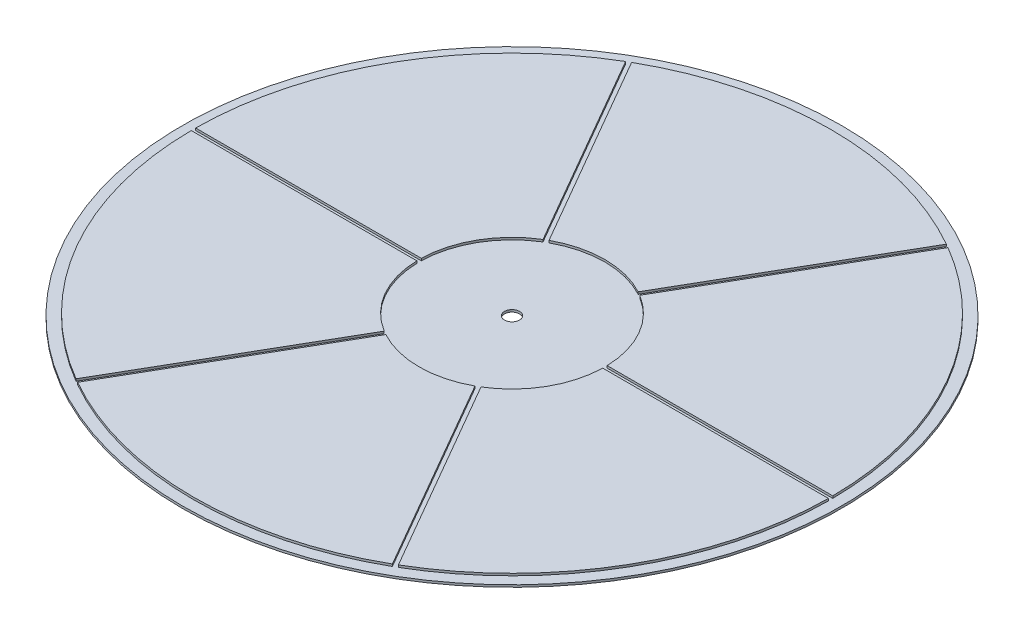
ISO-10303-21;
HEADER;
FILE_DESCRIPTION(('STEP AP214'),'2;1');
FILE_NAME('part.step','',(''),(''),'','','');
FILE_SCHEMA(('AUTOMOTIVE_DESIGN { 1 0 10303 214 1 1 1 1 }'));
ENDSEC;
DATA;
#1=APPLICATION_CONTEXT('core data for automotive mechanical design processes');
#2=APPLICATION_PROTOCOL_DEFINITION('international standard','automotive_design',2000,#1);
#3=PRODUCT_CONTEXT('',#1,'mechanical');
#4=PRODUCT('Part','Part','',(#3));
#5=PRODUCT_RELATED_PRODUCT_CATEGORY('part','',(#4));
#6=PRODUCT_DEFINITION_FORMATION('','',#4);
#7=PRODUCT_DEFINITION_CONTEXT('part definition',#1,'design');
#8=PRODUCT_DEFINITION('design','',#6,#7);
#9=PRODUCT_DEFINITION_SHAPE('','',#8);
#10=(LENGTH_UNIT() NAMED_UNIT(*) SI_UNIT(.MILLI.,.METRE.));
#11=(NAMED_UNIT(*) PLANE_ANGLE_UNIT() SI_UNIT($,.RADIAN.));
#12=(NAMED_UNIT(*) SI_UNIT($,.STERADIAN.) SOLID_ANGLE_UNIT());
#13=UNCERTAINTY_MEASURE_WITH_UNIT(LENGTH_MEASURE(1.E-05),#10,'distance_accuracy_value','');
#14=(GEOMETRIC_REPRESENTATION_CONTEXT(3) GLOBAL_UNCERTAINTY_ASSIGNED_CONTEXT((#13)) GLOBAL_UNIT_ASSIGNED_CONTEXT((#10,
#11,#12)) REPRESENTATION_CONTEXT('',''));
#15=CARTESIAN_POINT('',(0.,0.,0.));
#16=DIRECTION('',(0.,0.,1.));
#17=DIRECTION('',(1.,0.,0.));
#18=AXIS2_PLACEMENT_3D('',#15,#16,#17);
#19=CARTESIAN_POINT('',(485.479969334607,366.169733124094,241.10006139453));
#20=DIRECTION('',(0.,1.,0.));
#21=DIRECTION('',(0.,0.,1.));
#22=AXIS2_PLACEMENT_3D('',#19,#20,#21);
#23=PLANE('',#22);
#24=CARTESIAN_POINT('',(406.894917120642,366.169733124094,325.));
#25=DIRECTION('',(0.,1.,0.));
#26=DIRECTION('',(0.,0.,1.));
#27=AXIS2_PLACEMENT_3D('',#24,#25,#26);
#28=CIRCLE('',#27,145.);
#29=CARTESIAN_POINT('',(480.259218365994,366.169733124094,199.929302781262));
#30=VERTEX_POINT('',#29);
#31=CARTESIAN_POINT('',(551.891468803777,366.169733124094,324.));
#32=VERTEX_POINT('',#31);
#33=EDGE_CURVE('E197',#30,#32,#28,.F.);
#34=ORIENTED_EDGE('',*,*,#33,.F.);
#35=DIRECTION('',(-0.5,0.,0.866025403784439));
#36=VECTOR('',#35,1.);
#37=CARTESIAN_POINT('',(428.911221903505,366.169733124094,288.86664152116));
#38=LINE('',#37,#36);
#39=CARTESIAN_POINT('',(428.911221903505,366.169733124094,288.86664152116));
#40=VERTEX_POINT('',#39);
#41=EDGE_CURVE('E196',#40,#30,#38,.F.);
#42=ORIENTED_EDGE('',*,*,#41,.F.);
#43=CARTESIAN_POINT('',(406.894917120642,366.169733124094,325.));
#44=DIRECTION('',(0.,1.,0.));
#45=DIRECTION('',(0.,0.,1.));
#46=AXIS2_PLACEMENT_3D('',#43,#44,#45);
#47=CIRCLE('',#46,42.3123772819761);
#48=CARTESIAN_POINT('',(449.195475878799,366.169733124094,324.));
#49=VERTEX_POINT('',#48);
#50=EDGE_CURVE('E20',#40,#49,#47,.F.);
#51=ORIENTED_EDGE('',*,*,#50,.T.);
#52=DIRECTION('',(1.,0.,0.));
#53=VECTOR('',#52,1.);
#54=CARTESIAN_POINT('',(545.112341033228,366.169733124094,324.));
#55=LINE('',#54,#53);
#56=EDGE_CURVE('E182',#32,#49,#55,.F.);
#57=ORIENTED_EDGE('',*,*,#56,.F.);
#58=EDGE_LOOP('',(#34,#42,#51,#57));
#59=FACE_BOUND('',#58,.T.);
#60=ADVANCED_FACE('F17',(#59),#23,.T.);
#61=CARTESIAN_POINT('',(485.479969334607,366.169733124094,241.10006139453));
#62=DIRECTION('',(0.,1.,0.));
#63=DIRECTION('',(0.,0.,1.));
#64=AXIS2_PLACEMENT_3D('',#61,#62,#63);
#65=PLANE('',#64);
#66=CARTESIAN_POINT('',(406.894917120642,366.169733124094,325.));
#67=DIRECTION('',(0.,1.,0.));
#68=DIRECTION('',(0.,0.,1.));
#69=AXIS2_PLACEMENT_3D('',#66,#67,#68);
#70=CIRCLE('',#69,145.);
#71=CARTESIAN_POINT('',(478.527167558425,366.169733124094,451.070697218738));
#72=VERTEX_POINT('',#71);
#73=CARTESIAN_POINT('',(335.262666682859,366.169733124094,451.070697218738));
#74=VERTEX_POINT('',#73);
#75=EDGE_CURVE('E288',#72,#74,#70,.F.);
#76=ORIENTED_EDGE('',*,*,#75,.F.);
#77=DIRECTION('',(-0.5,0.,-0.866025403784439));
#78=VECTOR('',#77,1.);
#79=CARTESIAN_POINT('',(427.179171095936,366.169733124094,362.13335847884));
#80=LINE('',#79,#78);
#81=CARTESIAN_POINT('',(427.179171095936,366.169733124094,362.13335847884));
#82=VERTEX_POINT('',#81);
#83=EDGE_CURVE('E320',#82,#72,#80,.F.);
#84=ORIENTED_EDGE('',*,*,#83,.F.);
#85=CARTESIAN_POINT('',(406.894917120642,366.169733124094,325.));
#86=DIRECTION('',(0.,1.,0.));
#87=DIRECTION('',(0.,0.,1.));
#88=AXIS2_PLACEMENT_3D('',#85,#86,#87);
#89=CIRCLE('',#88,42.3123772819761);
#90=CARTESIAN_POINT('',(386.610663145348,366.169733124094,362.13335847884));
#91=VERTEX_POINT('',#90);
#92=EDGE_CURVE('E292',#82,#91,#89,.F.);
#93=ORIENTED_EDGE('',*,*,#92,.T.);
#94=DIRECTION('',(-0.5,0.,0.866025403784439));
#95=VECTOR('',#94,1.);
#96=CARTESIAN_POINT('',(338.652230568133,366.169733124094,445.199800353942));
#97=LINE('',#96,#95);
#98=EDGE_CURVE('E319',#74,#91,#97,.F.);
#99=ORIENTED_EDGE('',*,*,#98,.F.);
#100=EDGE_LOOP('',(#76,#84,#93,#99));
#101=FACE_BOUND('',#100,.T.);
#102=ADVANCED_FACE('F333',(#101),#65,.T.);
#103=CARTESIAN_POINT('',(485.479969334607,366.169733124094,241.10006139453));
#104=DIRECTION('',(0.,1.,0.));
#105=DIRECTION('',(0.,0.,1.));
#106=AXIS2_PLACEMENT_3D('',#103,#104,#105);
#107=PLANE('',#106);
#108=DIRECTION('',(0.5,0.,0.866025403784439));
#109=VECTOR('',#108,1.);
#110=CARTESIAN_POINT('',(386.610663145348,366.169733124094,287.86664152116));
#111=LINE('',#110,#109);
#112=CARTESIAN_POINT('',(386.610663145348,366.169733124094,287.86664152116));
#113=VERTEX_POINT('',#112);
#114=CARTESIAN_POINT('',(335.262666682859,366.169733124094,198.929302781262));
#115=VERTEX_POINT('',#114);
#116=EDGE_CURVE('E316',#113,#115,#111,.F.);
#117=ORIENTED_EDGE('',*,*,#116,.F.);
#118=CARTESIAN_POINT('',(406.894917120642,366.169733124094,325.));
#119=DIRECTION('',(0.,1.,0.));
#120=DIRECTION('',(0.,0.,1.));
#121=AXIS2_PLACEMENT_3D('',#118,#119,#120);
#122=CIRCLE('',#121,42.3123772819761);
#123=CARTESIAN_POINT('',(427.179171095936,366.169733124094,287.86664152116));
#124=VERTEX_POINT('',#123);
#125=EDGE_CURVE('E283',#113,#124,#122,.F.);
#126=ORIENTED_EDGE('',*,*,#125,.T.);
#127=DIRECTION('',(0.5,0.,-0.866025403784438));
#128=VECTOR('',#127,1.);
#129=CARTESIAN_POINT('',(475.137603673151,366.169733124094,204.800199646058));
#130=LINE('',#129,#128);
#131=CARTESIAN_POINT('',(478.527167558425,366.169733124094,198.929302781262));
#132=VERTEX_POINT('',#131);
#133=EDGE_CURVE('E287',#132,#124,#130,.F.);
#134=ORIENTED_EDGE('',*,*,#133,.F.);
#135=CARTESIAN_POINT('',(406.894917120642,366.169733124094,325.));
#136=DIRECTION('',(0.,1.,0.));
#137=DIRECTION('',(0.,0.,1.));
#138=AXIS2_PLACEMENT_3D('',#135,#136,#137);
#139=CIRCLE('',#138,145.);
#140=EDGE_CURVE('E279',#115,#132,#139,.F.);
#141=ORIENTED_EDGE('',*,*,#140,.F.);
#142=EDGE_LOOP('',(#117,#126,#134,#141));
#143=FACE_BOUND('',#142,.T.);
#144=ADVANCED_FACE('F653',(#143),#107,.T.);
#145=CARTESIAN_POINT('',(485.479969334607,366.169733124094,241.10006139453));
#146=DIRECTION('',(0.,1.,0.));
#147=DIRECTION('',(0.,0.,1.));
#148=AXIS2_PLACEMENT_3D('',#145,#146,#147);
#149=PLANE('',#148);
#150=DIRECTION('',(0.5,0.,-0.866025403784439));
#151=VECTOR('',#150,1.);
#152=CARTESIAN_POINT('',(384.878612337779,366.169733124094,361.13335847884));
#153=LINE('',#152,#151);
#154=CARTESIAN_POINT('',(384.878612337779,366.169733124094,361.13335847884));
#155=VERTEX_POINT('',#154);
#156=CARTESIAN_POINT('',(333.53061587529,366.169733124094,450.070697218738));
#157=VERTEX_POINT('',#156);
#158=EDGE_CURVE('E311',#155,#157,#153,.F.);
#159=ORIENTED_EDGE('',*,*,#158,.F.);
#160=CARTESIAN_POINT('',(406.894917120642,366.169733124094,325.));
#161=DIRECTION('',(0.,1.,0.));
#162=DIRECTION('',(0.,0.,1.));
#163=AXIS2_PLACEMENT_3D('',#160,#161,#162);
#164=CIRCLE('',#163,42.3123772819761);
#165=CARTESIAN_POINT('',(364.594358362485,366.169733124094,326.));
#166=VERTEX_POINT('',#165);
#167=EDGE_CURVE('E274',#155,#166,#164,.F.);
#168=ORIENTED_EDGE('',*,*,#167,.T.);
#169=DIRECTION('',(-1.,0.,0.));
#170=VECTOR('',#169,1.);
#171=CARTESIAN_POINT('',(268.677493208056,366.169733124094,326.));
#172=LINE('',#171,#170);
#173=CARTESIAN_POINT('',(261.898365437507,366.169733124094,326.));
#174=VERTEX_POINT('',#173);
#175=EDGE_CURVE('E278',#174,#166,#172,.F.);
#176=ORIENTED_EDGE('',*,*,#175,.F.);
#177=CARTESIAN_POINT('',(406.894917120642,366.169733124094,325.));
#178=DIRECTION('',(0.,1.,0.));
#179=DIRECTION('',(0.,0.,1.));
#180=AXIS2_PLACEMENT_3D('',#177,#178,#179);
#181=CIRCLE('',#180,145.);
#182=EDGE_CURVE('E270',#157,#174,#181,.F.);
#183=ORIENTED_EDGE('',*,*,#182,.F.);
#184=EDGE_LOOP('',(#159,#168,#176,#183));
#185=FACE_BOUND('',#184,.T.);
#186=ADVANCED_FACE('F644',(#185),#149,.T.);
#187=CARTESIAN_POINT('',(485.479969334607,366.169733124094,241.10006139453));
#188=DIRECTION('',(0.,1.,0.));
#189=DIRECTION('',(0.,0.,1.));
#190=AXIS2_PLACEMENT_3D('',#187,#188,#189);
#191=PLANE('',#190);
#192=CARTESIAN_POINT('',(406.894917120642,366.169733124094,325.));
#193=DIRECTION('',(0.,1.,0.));
#194=DIRECTION('',(0.,0.,1.));
#195=AXIS2_PLACEMENT_3D('',#192,#193,#194);
#196=CIRCLE('',#195,42.3123772819761);
#197=CARTESIAN_POINT('',(364.594358362485,366.169733124094,324.));
#198=VERTEX_POINT('',#197);
#199=CARTESIAN_POINT('',(384.878612337779,366.169733124094,288.86664152116));
#200=VERTEX_POINT('',#199);
#201=EDGE_CURVE('E265',#198,#200,#196,.F.);
#202=ORIENTED_EDGE('',*,*,#201,.T.);
#203=DIRECTION('',(-0.499999999999999,0.,-0.866025403784439));
#204=VECTOR('',#203,1.);
#205=CARTESIAN_POINT('',(336.920179760565,366.169733124094,205.800199646058));
#206=LINE('',#205,#204);
#207=CARTESIAN_POINT('',(333.53061587529,366.169733124094,199.929302781262));
#208=VERTEX_POINT('',#207);
#209=EDGE_CURVE('E269',#208,#200,#206,.F.);
#210=ORIENTED_EDGE('',*,*,#209,.F.);
#211=CARTESIAN_POINT('',(406.894917120642,366.169733124094,325.));
#212=DIRECTION('',(0.,1.,0.));
#213=DIRECTION('',(0.,0.,1.));
#214=AXIS2_PLACEMENT_3D('',#211,#212,#213);
#215=CIRCLE('',#214,145.);
#216=CARTESIAN_POINT('',(261.898365437507,366.169733124094,324.));
#217=VERTEX_POINT('',#216);
#218=EDGE_CURVE('E262',#217,#208,#215,.F.);
#219=ORIENTED_EDGE('',*,*,#218,.F.);
#220=DIRECTION('',(1.,0.,0.));
#221=VECTOR('',#220,1.);
#222=CARTESIAN_POINT('',(364.594358362485,366.169733124094,324.));
#223=LINE('',#222,#221);
#224=EDGE_CURVE('E307',#198,#217,#223,.F.);
#225=ORIENTED_EDGE('',*,*,#224,.F.);
#226=EDGE_LOOP('',(#202,#210,#219,#225));
#227=FACE_BOUND('',#226,.T.);
#228=ADVANCED_FACE('F635',(#227),#191,.T.);
#229=CARTESIAN_POINT('',(485.479969334607,366.169733124094,241.10006139453));
#230=DIRECTION('',(0.,1.,0.));
#231=DIRECTION('',(0.,0.,1.));
#232=AXIS2_PLACEMENT_3D('',#229,#230,#231);
#233=PLANE('',#232);
#234=CARTESIAN_POINT('',(406.894917120642,366.169733124094,325.));
#235=DIRECTION('',(0.,1.,0.));
#236=DIRECTION('',(0.,0.,1.));
#237=AXIS2_PLACEMENT_3D('',#234,#235,#236);
#238=CIRCLE('',#237,42.3123772819761);
#239=CARTESIAN_POINT('',(449.195475878799,366.169733124094,326.));
#240=VERTEX_POINT('',#239);
#241=CARTESIAN_POINT('',(428.911221903505,366.169733124094,361.13335847884));
#242=VERTEX_POINT('',#241);
#243=EDGE_CURVE('E253',#240,#242,#238,.F.);
#244=ORIENTED_EDGE('',*,*,#243,.T.);
#245=DIRECTION('',(0.5,0.,0.866025403784439));
#246=VECTOR('',#245,1.);
#247=CARTESIAN_POINT('',(476.869654480719,366.169733124094,444.199800353942));
#248=LINE('',#247,#246);
#249=CARTESIAN_POINT('',(480.259218365994,366.169733124094,450.070697218738));
#250=VERTEX_POINT('',#249);
#251=EDGE_CURVE('E257',#250,#242,#248,.F.);
#252=ORIENTED_EDGE('',*,*,#251,.F.);
#253=CARTESIAN_POINT('',(406.894917120642,366.169733124094,325.));
#254=DIRECTION('',(0.,1.,0.));
#255=DIRECTION('',(0.,0.,1.));
#256=AXIS2_PLACEMENT_3D('',#253,#254,#255);
#257=CIRCLE('',#256,145.);
#258=CARTESIAN_POINT('',(551.891468803777,366.169733124094,326.));
#259=VERTEX_POINT('',#258);
#260=EDGE_CURVE('E258',#259,#250,#257,.F.);
#261=ORIENTED_EDGE('',*,*,#260,.F.);
#262=DIRECTION('',(-1.,0.,0.));
#263=VECTOR('',#262,1.);
#264=CARTESIAN_POINT('',(449.195475878799,366.169733124094,326.));
#265=LINE('',#264,#263);
#266=EDGE_CURVE('E301',#240,#259,#265,.F.);
#267=ORIENTED_EDGE('',*,*,#266,.F.);
#268=EDGE_LOOP('',(#244,#252,#261,#267));
#269=FACE_BOUND('',#268,.T.);
#270=ADVANCED_FACE('F627',(#269),#233,.T.);
#271=CARTESIAN_POINT('',(545.112341033228,365.169733124094,324.));
#272=DIRECTION('',(0.,0.,1.));
#273=DIRECTION('',(1.,0.,0.));
#274=AXIS2_PLACEMENT_3D('',#271,#272,#273);
#275=PLANE('',#274);
#276=ORIENTED_EDGE('',*,*,#56,.T.);
#277=DIRECTION('',(0.,1.,0.));
#278=VECTOR('',#277,1.);
#279=CARTESIAN_POINT('',(449.195475878799,365.169733124094,324.));
#280=LINE('',#279,#278);
#281=CARTESIAN_POINT('',(449.195475878799,365.169733124094,324.));
#282=VERTEX_POINT('',#281);
#283=EDGE_CURVE('E185',#49,#282,#280,.F.);
#284=ORIENTED_EDGE('',*,*,#283,.T.);
#285=DIRECTION('',(1.,0.,0.));
#286=VECTOR('',#285,1.);
#287=CARTESIAN_POINT('',(486.299032483074,365.169733124094,324.));
#288=LINE('',#287,#286);
#289=CARTESIAN_POINT('',(551.891468803777,365.169733124094,324.));
#290=VERTEX_POINT('',#289);
#291=EDGE_CURVE('E252',#290,#282,#288,.F.);
#292=ORIENTED_EDGE('',*,*,#291,.F.);
#293=DIRECTION('',(0.,1.,0.));
#294=VECTOR('',#293,1.);
#295=CARTESIAN_POINT('',(551.891468803777,365.169733124094,324.));
#296=LINE('',#295,#294);
#297=EDGE_CURVE('E187',#32,#290,#296,.F.);
#298=ORIENTED_EDGE('',*,*,#297,.F.);
#299=EDGE_LOOP('',(#276,#284,#292,#298));
#300=FACE_BOUND('',#299,.T.);
#301=ADVANCED_FACE('F183',(#300),#275,.T.);
#302=CARTESIAN_POINT('',(406.894917120642,365.169733124094,325.));
#303=DIRECTION('',(0.,1.,0.));
#304=DIRECTION('',(0.,0.,1.));
#305=AXIS2_PLACEMENT_3D('',#302,#303,#304);
#306=CYLINDRICAL_SURFACE('',#305,42.3123772819761);
#307=ORIENTED_EDGE('',*,*,#283,.F.);
#308=ORIENTED_EDGE('',*,*,#50,.F.);
#309=DIRECTION('',(0.,1.,0.));
#310=VECTOR('',#309,1.);
#311=CARTESIAN_POINT('',(428.911221903505,365.169733124094,288.86664152116));
#312=LINE('',#311,#310);
#313=CARTESIAN_POINT('',(428.911221903505,365.169733124094,288.86664152116));
#314=VERTEX_POINT('',#313);
#315=EDGE_CURVE('E193',#314,#40,#312,.T.);
#316=ORIENTED_EDGE('',*,*,#315,.F.);
#317=CARTESIAN_POINT('',(406.894917120642,365.169733124094,325.));
#318=DIRECTION('',(0.,1.,0.));
#319=DIRECTION('',(0.,0.,1.));
#320=AXIS2_PLACEMENT_3D('',#317,#318,#319);
#321=CIRCLE('',#320,42.3123772819761);
#322=EDGE_CURVE('E192',#282,#314,#321,.T.);
#323=ORIENTED_EDGE('',*,*,#322,.F.);
#324=EDGE_LOOP('',(#307,#308,#316,#323));
#325=FACE_BOUND('',#324,.T.);
#326=ADVANCED_FACE('F191',(#325),#306,.F.);
#327=CARTESIAN_POINT('',(428.911221903505,365.169733124094,288.86664152116));
#328=DIRECTION('',(-0.866025403784439,0.,-0.5));
#329=DIRECTION('',(-0.5,0.,0.866025403784439));
#330=AXIS2_PLACEMENT_3D('',#327,#328,#329);
#331=PLANE('',#330);
#332=ORIENTED_EDGE('',*,*,#41,.T.);
#333=DIRECTION('',(0.,1.,0.));
#334=VECTOR('',#333,1.);
#335=CARTESIAN_POINT('',(480.259218365994,365.169733124094,199.929302781262));
#336=LINE('',#335,#334);
#337=CARTESIAN_POINT('',(480.259218365994,365.169733124094,199.929302781262));
#338=VERTEX_POINT('',#337);
#339=EDGE_CURVE('E201',#338,#30,#336,.T.);
#340=ORIENTED_EDGE('',*,*,#339,.F.);
#341=DIRECTION('',(0.5,0.,-0.866025403784439));
#342=VECTOR('',#341,1.);
#343=CARTESIAN_POINT('',(428.911221903505,365.169733124094,288.86664152116));
#344=LINE('',#343,#342);
#345=EDGE_CURVE('E250',#314,#338,#344,.T.);
#346=ORIENTED_EDGE('',*,*,#345,.F.);
#347=ORIENTED_EDGE('',*,*,#315,.T.);
#348=EDGE_LOOP('',(#332,#340,#346,#347));
#349=FACE_BOUND('',#348,.T.);
#350=ADVANCED_FACE('F363',(#349),#331,.T.);
#351=CARTESIAN_POINT('',(406.894917120642,365.169733124094,325.));
#352=DIRECTION('',(0.,1.,0.));
#353=DIRECTION('',(0.,0.,1.));
#354=AXIS2_PLACEMENT_3D('',#351,#352,#353);
#355=CYLINDRICAL_SURFACE('',#354,145.);
#356=ORIENTED_EDGE('',*,*,#33,.T.);
#357=ORIENTED_EDGE('',*,*,#297,.T.);
#358=CARTESIAN_POINT('',(406.894917120642,365.169733124094,325.));
#359=DIRECTION('',(0.,1.,0.));
#360=DIRECTION('',(0.,0.,1.));
#361=AXIS2_PLACEMENT_3D('',#358,#359,#360);
#362=CIRCLE('',#361,145.);
#363=EDGE_CURVE('E247',#338,#290,#362,.F.);
#364=ORIENTED_EDGE('',*,*,#363,.F.);
#365=ORIENTED_EDGE('',*,*,#339,.T.);
#366=EDGE_LOOP('',(#356,#357,#364,#365));
#367=FACE_BOUND('',#366,.T.);
#368=ADVANCED_FACE('F355',(#367),#355,.T.);
#369=CARTESIAN_POINT('',(406.894917120642,365.169733124094,325.));
#370=DIRECTION('',(0.,1.,0.));
#371=DIRECTION('',(0.,0.,1.));
#372=AXIS2_PLACEMENT_3D('',#369,#370,#371);
#373=CYLINDRICAL_SURFACE('',#372,42.3123772819761);
#374=DIRECTION('',(0.,1.,0.));
#375=VECTOR('',#374,1.);
#376=CARTESIAN_POINT('',(386.610663145348,365.169733124094,362.13335847884));
#377=LINE('',#376,#375);
#378=CARTESIAN_POINT('',(386.610663145348,365.169733124094,362.13335847884));
#379=VERTEX_POINT('',#378);
#380=EDGE_CURVE('E315',#91,#379,#377,.F.);
#381=ORIENTED_EDGE('',*,*,#380,.F.);
#382=ORIENTED_EDGE('',*,*,#92,.F.);
#383=DIRECTION('',(0.,1.,0.));
#384=VECTOR('',#383,1.);
#385=CARTESIAN_POINT('',(427.179171095936,365.169733124094,362.13335847884));
#386=LINE('',#385,#384);
#387=CARTESIAN_POINT('',(427.179171095936,365.169733124094,362.13335847884));
#388=VERTEX_POINT('',#387);
#389=EDGE_CURVE('E294',#388,#82,#386,.T.);
#390=ORIENTED_EDGE('',*,*,#389,.F.);
#391=CARTESIAN_POINT('',(406.894917120642,365.169733124094,325.));
#392=DIRECTION('',(0.,1.,0.));
#393=DIRECTION('',(0.,0.,1.));
#394=AXIS2_PLACEMENT_3D('',#391,#392,#393);
#395=CIRCLE('',#394,42.3123772819761);
#396=EDGE_CURVE('E245',#379,#388,#395,.T.);
#397=ORIENTED_EDGE('',*,*,#396,.F.);
#398=EDGE_LOOP('',(#381,#382,#390,#397));
#399=FACE_BOUND('',#398,.T.);
#400=ADVANCED_FACE('F353',(#399),#373,.F.);
#401=CARTESIAN_POINT('',(427.179171095936,365.169733124094,362.13335847884));
#402=DIRECTION('',(0.866025403784439,0.,-0.5));
#403=DIRECTION('',(-0.5,0.,-0.866025403784439));
#404=AXIS2_PLACEMENT_3D('',#401,#402,#403);
#405=PLANE('',#404);
#406=ORIENTED_EDGE('',*,*,#83,.T.);
#407=DIRECTION('',(0.,1.,0.));
#408=VECTOR('',#407,1.);
#409=CARTESIAN_POINT('',(478.527167558425,365.169733124094,451.070697218738));
#410=LINE('',#409,#408);
#411=CARTESIAN_POINT('',(478.527167558425,365.169733124094,451.070697218738));
#412=VERTEX_POINT('',#411);
#413=EDGE_CURVE('E291',#412,#72,#410,.T.);
#414=ORIENTED_EDGE('',*,*,#413,.F.);
#415=DIRECTION('',(0.5,0.,0.866025403784439));
#416=VECTOR('',#415,1.);
#417=CARTESIAN_POINT('',(427.179171095936,365.169733124094,362.13335847884));
#418=LINE('',#417,#416);
#419=EDGE_CURVE('E244',#388,#412,#418,.T.);
#420=ORIENTED_EDGE('',*,*,#419,.F.);
#421=ORIENTED_EDGE('',*,*,#389,.T.);
#422=EDGE_LOOP('',(#406,#414,#420,#421));
#423=FACE_BOUND('',#422,.T.);
#424=ADVANCED_FACE('F328',(#423),#405,.T.);
#425=CARTESIAN_POINT('',(406.894917120642,365.169733124094,325.));
#426=DIRECTION('',(0.,1.,0.));
#427=DIRECTION('',(0.,0.,1.));
#428=AXIS2_PLACEMENT_3D('',#425,#426,#427);
#429=CYLINDRICAL_SURFACE('',#428,145.);
#430=ORIENTED_EDGE('',*,*,#75,.T.);
#431=DIRECTION('',(0.,1.,0.));
#432=VECTOR('',#431,1.);
#433=CARTESIAN_POINT('',(335.262666682859,365.169733124094,451.070697218738));
#434=LINE('',#433,#432);
#435=CARTESIAN_POINT('',(335.262666682859,365.169733124094,451.070697218738));
#436=VERTEX_POINT('',#435);
#437=EDGE_CURVE('E290',#436,#74,#434,.T.);
#438=ORIENTED_EDGE('',*,*,#437,.F.);
#439=CARTESIAN_POINT('',(406.894917120642,365.169733124094,325.));
#440=DIRECTION('',(0.,1.,0.));
#441=DIRECTION('',(0.,0.,1.));
#442=AXIS2_PLACEMENT_3D('',#439,#440,#441);
#443=CIRCLE('',#442,145.);
#444=EDGE_CURVE('E241',#412,#436,#443,.F.);
#445=ORIENTED_EDGE('',*,*,#444,.F.);
#446=ORIENTED_EDGE('',*,*,#413,.T.);
#447=EDGE_LOOP('',(#430,#438,#445,#446));
#448=FACE_BOUND('',#447,.T.);
#449=ADVANCED_FACE('F339',(#448),#429,.T.);
#450=CARTESIAN_POINT('',(338.652230568133,365.169733124094,445.199800353942));
#451=DIRECTION('',(-0.866025403784439,0.,-0.5));
#452=DIRECTION('',(-0.5,0.,0.866025403784439));
#453=AXIS2_PLACEMENT_3D('',#450,#451,#452);
#454=PLANE('',#453);
#455=ORIENTED_EDGE('',*,*,#98,.T.);
#456=ORIENTED_EDGE('',*,*,#380,.T.);
#457=DIRECTION('',(0.5,0.,-0.866025403784439));
#458=VECTOR('',#457,1.);
#459=CARTESIAN_POINT('',(335.262666682859,365.169733124094,451.070697218738));
#460=LINE('',#459,#458);
#461=EDGE_CURVE('E243',#436,#379,#460,.T.);
#462=ORIENTED_EDGE('',*,*,#461,.F.);
#463=ORIENTED_EDGE('',*,*,#437,.T.);
#464=EDGE_LOOP('',(#455,#456,#462,#463));
#465=FACE_BOUND('',#464,.T.);
#466=ADVANCED_FACE('F343',(#465),#454,.T.);
#467=CARTESIAN_POINT('',(475.137603673151,365.169733124094,204.800199646058));
#468=DIRECTION('',(0.866025403784438,0.,0.5));
#469=DIRECTION('',(0.5,0.,-0.866025403784438));
#470=AXIS2_PLACEMENT_3D('',#467,#468,#469);
#471=PLANE('',#470);
#472=ORIENTED_EDGE('',*,*,#133,.T.);
#473=DIRECTION('',(0.,1.,0.));
#474=VECTOR('',#473,1.);
#475=CARTESIAN_POINT('',(427.179171095936,365.169733124094,287.86664152116));
#476=LINE('',#475,#474);
#477=CARTESIAN_POINT('',(427.179171095936,365.169733124094,287.86664152116));
#478=VERTEX_POINT('',#477);
#479=EDGE_CURVE('E286',#124,#478,#476,.F.);
#480=ORIENTED_EDGE('',*,*,#479,.T.);
#481=DIRECTION('',(-0.5,0.,0.866025403784439));
#482=VECTOR('',#481,1.);
#483=CARTESIAN_POINT('',(478.527167558425,365.169733124094,198.929302781262));
#484=LINE('',#483,#482);
#485=CARTESIAN_POINT('',(478.527167558425,365.169733124094,198.929302781262));
#486=VERTEX_POINT('',#485);
#487=EDGE_CURVE('E240',#486,#478,#484,.T.);
#488=ORIENTED_EDGE('',*,*,#487,.F.);
#489=DIRECTION('',(0.,1.,0.));
#490=VECTOR('',#489,1.);
#491=CARTESIAN_POINT('',(478.527167558425,365.169733124094,198.929302781262));
#492=LINE('',#491,#490);
#493=EDGE_CURVE('E281',#132,#486,#492,.F.);
#494=ORIENTED_EDGE('',*,*,#493,.F.);
#495=EDGE_LOOP('',(#472,#480,#488,#494));
#496=FACE_BOUND('',#495,.T.);
#497=ADVANCED_FACE('F444',(#496),#471,.T.);
#498=CARTESIAN_POINT('',(406.894917120642,365.169733124094,325.));
#499=DIRECTION('',(0.,1.,0.));
#500=DIRECTION('',(0.,0.,1.));
#501=AXIS2_PLACEMENT_3D('',#498,#499,#500);
#502=CYLINDRICAL_SURFACE('',#501,42.3123772819761);
#503=ORIENTED_EDGE('',*,*,#479,.F.);
#504=ORIENTED_EDGE('',*,*,#125,.F.);
#505=DIRECTION('',(0.,1.,0.));
#506=VECTOR('',#505,1.);
#507=CARTESIAN_POINT('',(386.610663145348,365.169733124094,287.86664152116));
#508=LINE('',#507,#506);
#509=CARTESIAN_POINT('',(386.610663145348,365.169733124094,287.86664152116));
#510=VERTEX_POINT('',#509);
#511=EDGE_CURVE('E318',#510,#113,#508,.T.);
#512=ORIENTED_EDGE('',*,*,#511,.F.);
#513=CARTESIAN_POINT('',(406.894917120642,365.169733124094,325.));
#514=DIRECTION('',(0.,1.,0.));
#515=DIRECTION('',(0.,0.,1.));
#516=AXIS2_PLACEMENT_3D('',#513,#514,#515);
#517=CIRCLE('',#516,42.3123772819761);
#518=EDGE_CURVE('E238',#478,#510,#517,.T.);
#519=ORIENTED_EDGE('',*,*,#518,.F.);
#520=EDGE_LOOP('',(#503,#504,#512,#519));
#521=FACE_BOUND('',#520,.T.);
#522=ADVANCED_FACE('F440',(#521),#502,.F.);
#523=CARTESIAN_POINT('',(386.610663145348,365.169733124094,287.86664152116));
#524=DIRECTION('',(-0.866025403784439,0.,0.5));
#525=DIRECTION('',(0.5,0.,0.866025403784439));
#526=AXIS2_PLACEMENT_3D('',#523,#524,#525);
#527=PLANE('',#526);
#528=ORIENTED_EDGE('',*,*,#116,.T.);
#529=DIRECTION('',(0.,1.,0.));
#530=VECTOR('',#529,1.);
#531=CARTESIAN_POINT('',(335.262666682859,365.169733124094,198.929302781262));
#532=LINE('',#531,#530);
#533=CARTESIAN_POINT('',(335.262666682859,365.169733124094,198.929302781262));
#534=VERTEX_POINT('',#533);
#535=EDGE_CURVE('E282',#534,#115,#532,.T.);
#536=ORIENTED_EDGE('',*,*,#535,.F.);
#537=DIRECTION('',(-0.5,0.,-0.866025403784439));
#538=VECTOR('',#537,1.);
#539=CARTESIAN_POINT('',(386.610663145348,365.169733124094,287.86664152116));
#540=LINE('',#539,#538);
#541=EDGE_CURVE('E237',#510,#534,#540,.T.);
#542=ORIENTED_EDGE('',*,*,#541,.F.);
#543=ORIENTED_EDGE('',*,*,#511,.T.);
#544=EDGE_LOOP('',(#528,#536,#542,#543));
#545=FACE_BOUND('',#544,.T.);
#546=ADVANCED_FACE('F436',(#545),#527,.T.);
#547=CARTESIAN_POINT('',(406.894917120642,365.169733124094,325.));
#548=DIRECTION('',(0.,1.,0.));
#549=DIRECTION('',(0.,0.,1.));
#550=AXIS2_PLACEMENT_3D('',#547,#548,#549);
#551=CYLINDRICAL_SURFACE('',#550,145.);
#552=ORIENTED_EDGE('',*,*,#140,.T.);
#553=ORIENTED_EDGE('',*,*,#493,.T.);
#554=CARTESIAN_POINT('',(406.894917120642,365.169733124094,325.));
#555=DIRECTION('',(0.,1.,0.));
#556=DIRECTION('',(0.,0.,1.));
#557=AXIS2_PLACEMENT_3D('',#554,#555,#556);
#558=CIRCLE('',#557,145.);
#559=EDGE_CURVE('E234',#534,#486,#558,.F.);
#560=ORIENTED_EDGE('',*,*,#559,.F.);
#561=ORIENTED_EDGE('',*,*,#535,.T.);
#562=EDGE_LOOP('',(#552,#553,#560,#561));
#563=FACE_BOUND('',#562,.T.);
#564=ADVANCED_FACE('F432',(#563),#551,.T.);
#565=CARTESIAN_POINT('',(268.677493208056,365.169733124094,326.));
#566=DIRECTION('',(0.,0.,-1.));
#567=DIRECTION('',(-1.,0.,0.));
#568=AXIS2_PLACEMENT_3D('',#565,#566,#567);
#569=PLANE('',#568);
#570=ORIENTED_EDGE('',*,*,#175,.T.);
#571=DIRECTION('',(0.,1.,0.));
#572=VECTOR('',#571,1.);
#573=CARTESIAN_POINT('',(364.594358362485,365.169733124094,326.));
#574=LINE('',#573,#572);
#575=CARTESIAN_POINT('',(364.594358362485,365.169733124094,326.));
#576=VERTEX_POINT('',#575);
#577=EDGE_CURVE('E277',#166,#576,#574,.F.);
#578=ORIENTED_EDGE('',*,*,#577,.T.);
#579=DIRECTION('',(1.,0.,0.));
#580=VECTOR('',#579,1.);
#581=CARTESIAN_POINT('',(486.299032483074,365.169733124094,326.));
#582=LINE('',#581,#580);
#583=CARTESIAN_POINT('',(261.898365437507,365.169733124094,326.));
#584=VERTEX_POINT('',#583);
#585=EDGE_CURVE('E233',#584,#576,#582,.T.);
#586=ORIENTED_EDGE('',*,*,#585,.F.);
#587=DIRECTION('',(0.,1.,0.));
#588=VECTOR('',#587,1.);
#589=CARTESIAN_POINT('',(261.898365437507,365.169733124094,326.));
#590=LINE('',#589,#588);
#591=EDGE_CURVE('E272',#174,#584,#590,.F.);
#592=ORIENTED_EDGE('',*,*,#591,.F.);
#593=EDGE_LOOP('',(#570,#578,#586,#592));
#594=FACE_BOUND('',#593,.T.);
#595=ADVANCED_FACE('F428',(#594),#569,.T.);
#596=CARTESIAN_POINT('',(406.894917120642,365.169733124094,325.));
#597=DIRECTION('',(0.,1.,0.));
#598=DIRECTION('',(0.,0.,1.));
#599=AXIS2_PLACEMENT_3D('',#596,#597,#598);
#600=CYLINDRICAL_SURFACE('',#599,42.3123772819761);
#601=ORIENTED_EDGE('',*,*,#577,.F.);
#602=ORIENTED_EDGE('',*,*,#167,.F.);
#603=DIRECTION('',(0.,1.,0.));
#604=VECTOR('',#603,1.);
#605=CARTESIAN_POINT('',(384.878612337779,365.169733124094,361.13335847884));
#606=LINE('',#605,#604);
#607=CARTESIAN_POINT('',(384.878612337779,365.169733124094,361.13335847884));
#608=VERTEX_POINT('',#607);
#609=EDGE_CURVE('E313',#608,#155,#606,.T.);
#610=ORIENTED_EDGE('',*,*,#609,.F.);
#611=CARTESIAN_POINT('',(406.894917120642,365.169733124094,325.));
#612=DIRECTION('',(0.,1.,0.));
#613=DIRECTION('',(0.,0.,1.));
#614=AXIS2_PLACEMENT_3D('',#611,#612,#613);
#615=CIRCLE('',#614,42.3123772819761);
#616=EDGE_CURVE('E231',#576,#608,#615,.T.);
#617=ORIENTED_EDGE('',*,*,#616,.F.);
#618=EDGE_LOOP('',(#601,#602,#610,#617));
#619=FACE_BOUND('',#618,.T.);
#620=ADVANCED_FACE('F424',(#619),#600,.F.);
#621=CARTESIAN_POINT('',(384.878612337779,365.169733124094,361.13335847884));
#622=DIRECTION('',(0.866025403784439,0.,0.5));
#623=DIRECTION('',(0.5,0.,-0.866025403784439));
#624=AXIS2_PLACEMENT_3D('',#621,#622,#623);
#625=PLANE('',#624);
#626=ORIENTED_EDGE('',*,*,#158,.T.);
#627=DIRECTION('',(0.,1.,0.));
#628=VECTOR('',#627,1.);
#629=CARTESIAN_POINT('',(333.53061587529,365.169733124094,450.070697218738));
#630=LINE('',#629,#628);
#631=CARTESIAN_POINT('',(333.53061587529,365.169733124094,450.070697218738));
#632=VERTEX_POINT('',#631);
#633=EDGE_CURVE('E273',#632,#157,#630,.T.);
#634=ORIENTED_EDGE('',*,*,#633,.F.);
#635=DIRECTION('',(-0.5,0.,0.866025403784439));
#636=VECTOR('',#635,1.);
#637=CARTESIAN_POINT('',(384.878612337779,365.169733124094,361.13335847884));
#638=LINE('',#637,#636);
#639=EDGE_CURVE('E230',#608,#632,#638,.T.);
#640=ORIENTED_EDGE('',*,*,#639,.F.);
#641=ORIENTED_EDGE('',*,*,#609,.T.);
#642=EDGE_LOOP('',(#626,#634,#640,#641));
#643=FACE_BOUND('',#642,.T.);
#644=ADVANCED_FACE('F420',(#643),#625,.T.);
#645=CARTESIAN_POINT('',(406.894917120642,365.169733124094,325.));
#646=DIRECTION('',(0.,1.,0.));
#647=DIRECTION('',(0.,0.,1.));
#648=AXIS2_PLACEMENT_3D('',#645,#646,#647);
#649=CYLINDRICAL_SURFACE('',#648,145.);
#650=ORIENTED_EDGE('',*,*,#182,.T.);
#651=ORIENTED_EDGE('',*,*,#591,.T.);
#652=CARTESIAN_POINT('',(406.894917120642,365.169733124094,325.));
#653=DIRECTION('',(0.,1.,0.));
#654=DIRECTION('',(0.,0.,1.));
#655=AXIS2_PLACEMENT_3D('',#652,#653,#654);
#656=CIRCLE('',#655,145.);
#657=EDGE_CURVE('E227',#632,#584,#656,.F.);
#658=ORIENTED_EDGE('',*,*,#657,.F.);
#659=ORIENTED_EDGE('',*,*,#633,.T.);
#660=EDGE_LOOP('',(#650,#651,#658,#659));
#661=FACE_BOUND('',#660,.T.);
#662=ADVANCED_FACE('F416',(#661),#649,.T.);
#663=CARTESIAN_POINT('',(336.920179760565,365.169733124094,205.800199646058));
#664=DIRECTION('',(0.866025403784439,0.,-0.499999999999999));
#665=DIRECTION('',(-0.499999999999999,0.,-0.866025403784439));
#666=AXIS2_PLACEMENT_3D('',#663,#664,#665);
#667=PLANE('',#666);
#668=ORIENTED_EDGE('',*,*,#209,.T.);
#669=DIRECTION('',(0.,1.,0.));
#670=VECTOR('',#669,1.);
#671=CARTESIAN_POINT('',(384.878612337779,365.169733124094,288.86664152116));
#672=LINE('',#671,#670);
#673=CARTESIAN_POINT('',(384.878612337779,365.169733124094,288.86664152116));
#674=VERTEX_POINT('',#673);
#675=EDGE_CURVE('E268',#200,#674,#672,.F.);
#676=ORIENTED_EDGE('',*,*,#675,.T.);
#677=DIRECTION('',(0.5,0.,0.866025403784439));
#678=VECTOR('',#677,1.);
#679=CARTESIAN_POINT('',(333.53061587529,365.169733124094,199.929302781262));
#680=LINE('',#679,#678);
#681=CARTESIAN_POINT('',(333.53061587529,365.169733124094,199.929302781262));
#682=VERTEX_POINT('',#681);
#683=EDGE_CURVE('E226',#682,#674,#680,.T.);
#684=ORIENTED_EDGE('',*,*,#683,.F.);
#685=DIRECTION('',(0.,1.,0.));
#686=VECTOR('',#685,1.);
#687=CARTESIAN_POINT('',(333.53061587529,365.169733124094,199.929302781262));
#688=LINE('',#687,#686);
#689=EDGE_CURVE('E261',#208,#682,#688,.F.);
#690=ORIENTED_EDGE('',*,*,#689,.F.);
#691=EDGE_LOOP('',(#668,#676,#684,#690));
#692=FACE_BOUND('',#691,.T.);
#693=ADVANCED_FACE('F412',(#692),#667,.T.);
#694=CARTESIAN_POINT('',(406.894917120642,365.169733124094,325.));
#695=DIRECTION('',(0.,1.,0.));
#696=DIRECTION('',(0.,0.,1.));
#697=AXIS2_PLACEMENT_3D('',#694,#695,#696);
#698=CYLINDRICAL_SURFACE('',#697,42.3123772819761);
#699=ORIENTED_EDGE('',*,*,#675,.F.);
#700=ORIENTED_EDGE('',*,*,#201,.F.);
#701=DIRECTION('',(0.,1.,0.));
#702=VECTOR('',#701,1.);
#703=CARTESIAN_POINT('',(364.594358362485,365.169733124094,324.));
#704=LINE('',#703,#702);
#705=CARTESIAN_POINT('',(364.594358362485,365.169733124094,324.));
#706=VERTEX_POINT('',#705);
#707=EDGE_CURVE('E309',#706,#198,#704,.T.);
#708=ORIENTED_EDGE('',*,*,#707,.F.);
#709=CARTESIAN_POINT('',(406.894917120642,365.169733124094,325.));
#710=DIRECTION('',(0.,1.,0.));
#711=DIRECTION('',(0.,0.,1.));
#712=AXIS2_PLACEMENT_3D('',#709,#710,#711);
#713=CIRCLE('',#712,42.3123772819761);
#714=EDGE_CURVE('E224',#674,#706,#713,.T.);
#715=ORIENTED_EDGE('',*,*,#714,.F.);
#716=EDGE_LOOP('',(#699,#700,#708,#715));
#717=FACE_BOUND('',#716,.T.);
#718=ADVANCED_FACE('F408',(#717),#698,.F.);
#719=CARTESIAN_POINT('',(364.594358362485,365.169733124094,324.));
#720=DIRECTION('',(0.,0.,1.));
#721=DIRECTION('',(1.,0.,0.));
#722=AXIS2_PLACEMENT_3D('',#719,#720,#721);
#723=PLANE('',#722);
#724=ORIENTED_EDGE('',*,*,#224,.T.);
#725=DIRECTION('',(0.,1.,0.));
#726=VECTOR('',#725,1.);
#727=CARTESIAN_POINT('',(261.898365437507,365.169733124094,324.));
#728=LINE('',#727,#726);
#729=CARTESIAN_POINT('',(261.898365437507,365.169733124094,324.));
#730=VERTEX_POINT('',#729);
#731=EDGE_CURVE('E264',#730,#217,#728,.T.);
#732=ORIENTED_EDGE('',*,*,#731,.F.);
#733=DIRECTION('',(1.,0.,0.));
#734=VECTOR('',#733,1.);
#735=CARTESIAN_POINT('',(486.299032483074,365.169733124094,324.));
#736=LINE('',#735,#734);
#737=EDGE_CURVE('E223',#706,#730,#736,.F.);
#738=ORIENTED_EDGE('',*,*,#737,.F.);
#739=ORIENTED_EDGE('',*,*,#707,.T.);
#740=EDGE_LOOP('',(#724,#732,#738,#739));
#741=FACE_BOUND('',#740,.T.);
#742=ADVANCED_FACE('F404',(#741),#723,.T.);
#743=CARTESIAN_POINT('',(406.894917120642,365.169733124094,325.));
#744=DIRECTION('',(0.,1.,0.));
#745=DIRECTION('',(0.,0.,1.));
#746=AXIS2_PLACEMENT_3D('',#743,#744,#745);
#747=CYLINDRICAL_SURFACE('',#746,145.);
#748=ORIENTED_EDGE('',*,*,#218,.T.);
#749=ORIENTED_EDGE('',*,*,#689,.T.);
#750=CARTESIAN_POINT('',(406.894917120642,365.169733124094,325.));
#751=DIRECTION('',(0.,1.,0.));
#752=DIRECTION('',(0.,0.,1.));
#753=AXIS2_PLACEMENT_3D('',#750,#751,#752);
#754=CIRCLE('',#753,145.);
#755=EDGE_CURVE('E220',#730,#682,#754,.F.);
#756=ORIENTED_EDGE('',*,*,#755,.F.);
#757=ORIENTED_EDGE('',*,*,#731,.T.);
#758=EDGE_LOOP('',(#748,#749,#756,#757));
#759=FACE_BOUND('',#758,.T.);
#760=ADVANCED_FACE('F400',(#759),#747,.T.);
#761=CARTESIAN_POINT('',(406.894917120642,365.169733124094,325.));
#762=DIRECTION('',(0.,1.,0.));
#763=DIRECTION('',(0.,0.,1.));
#764=AXIS2_PLACEMENT_3D('',#761,#762,#763);
#765=CYLINDRICAL_SURFACE('',#764,145.);
#766=ORIENTED_EDGE('',*,*,#260,.T.);
#767=DIRECTION('',(0.,1.,0.));
#768=VECTOR('',#767,1.);
#769=CARTESIAN_POINT('',(480.259218365994,365.169733124094,450.070697218738));
#770=LINE('',#769,#768);
#771=CARTESIAN_POINT('',(480.259218365994,365.169733124094,450.070697218738));
#772=VERTEX_POINT('',#771);
#773=EDGE_CURVE('E260',#772,#250,#770,.T.);
#774=ORIENTED_EDGE('',*,*,#773,.F.);
#775=CARTESIAN_POINT('',(406.894917120642,365.169733124094,325.));
#776=DIRECTION('',(0.,1.,0.));
#777=DIRECTION('',(0.,0.,1.));
#778=AXIS2_PLACEMENT_3D('',#775,#776,#777);
#779=CIRCLE('',#778,145.);
#780=CARTESIAN_POINT('',(551.891468803777,365.169733124094,326.));
#781=VERTEX_POINT('',#780);
#782=EDGE_CURVE('E218',#781,#772,#779,.F.);
#783=ORIENTED_EDGE('',*,*,#782,.F.);
#784=DIRECTION('',(0.,1.,0.));
#785=VECTOR('',#784,1.);
#786=CARTESIAN_POINT('',(551.891468803777,365.169733124094,326.));
#787=LINE('',#786,#785);
#788=EDGE_CURVE('E303',#259,#781,#787,.F.);
#789=ORIENTED_EDGE('',*,*,#788,.F.);
#790=EDGE_LOOP('',(#766,#774,#783,#789));
#791=FACE_BOUND('',#790,.T.);
#792=ADVANCED_FACE('F396',(#791),#765,.T.);
#793=CARTESIAN_POINT('',(476.869654480719,365.169733124094,444.199800353942));
#794=DIRECTION('',(-0.866025403784439,0.,0.5));
#795=DIRECTION('',(0.5,0.,0.866025403784439));
#796=AXIS2_PLACEMENT_3D('',#793,#794,#795);
#797=PLANE('',#796);
#798=ORIENTED_EDGE('',*,*,#251,.T.);
#799=DIRECTION('',(0.,1.,0.));
#800=VECTOR('',#799,1.);
#801=CARTESIAN_POINT('',(428.911221903505,365.169733124094,361.13335847884));
#802=LINE('',#801,#800);
#803=CARTESIAN_POINT('',(428.911221903505,365.169733124094,361.13335847884));
#804=VERTEX_POINT('',#803);
#805=EDGE_CURVE('E256',#242,#804,#802,.F.);
#806=ORIENTED_EDGE('',*,*,#805,.T.);
#807=DIRECTION('',(-0.5,0.,-0.866025403784439));
#808=VECTOR('',#807,1.);
#809=CARTESIAN_POINT('',(480.259218365994,365.169733124094,450.070697218738));
#810=LINE('',#809,#808);
#811=EDGE_CURVE('E217',#772,#804,#810,.T.);
#812=ORIENTED_EDGE('',*,*,#811,.F.);
#813=ORIENTED_EDGE('',*,*,#773,.T.);
#814=EDGE_LOOP('',(#798,#806,#812,#813));
#815=FACE_BOUND('',#814,.T.);
#816=ADVANCED_FACE('F392',(#815),#797,.T.);
#817=CARTESIAN_POINT('',(406.894917120642,365.169733124094,325.));
#818=DIRECTION('',(0.,1.,0.));
#819=DIRECTION('',(0.,0.,1.));
#820=AXIS2_PLACEMENT_3D('',#817,#818,#819);
#821=CYLINDRICAL_SURFACE('',#820,42.3123772819761);
#822=ORIENTED_EDGE('',*,*,#805,.F.);
#823=ORIENTED_EDGE('',*,*,#243,.F.);
#824=DIRECTION('',(0.,1.,0.));
#825=VECTOR('',#824,1.);
#826=CARTESIAN_POINT('',(449.195475878799,365.169733124094,326.));
#827=LINE('',#826,#825);
#828=CARTESIAN_POINT('',(449.195475878799,365.169733124094,326.));
#829=VERTEX_POINT('',#828);
#830=EDGE_CURVE('E304',#829,#240,#827,.T.);
#831=ORIENTED_EDGE('',*,*,#830,.F.);
#832=CARTESIAN_POINT('',(406.894917120642,365.169733124094,325.));
#833=DIRECTION('',(0.,1.,0.));
#834=DIRECTION('',(0.,0.,1.));
#835=AXIS2_PLACEMENT_3D('',#832,#833,#834);
#836=CIRCLE('',#835,42.3123772819761);
#837=EDGE_CURVE('E35',#804,#829,#836,.T.);
#838=ORIENTED_EDGE('',*,*,#837,.F.);
#839=EDGE_LOOP('',(#822,#823,#831,#838));
#840=FACE_BOUND('',#839,.T.);
#841=ADVANCED_FACE('F388',(#840),#821,.F.);
#842=CARTESIAN_POINT('',(449.195475878799,365.169733124094,326.));
#843=DIRECTION('',(0.,0.,-1.));
#844=DIRECTION('',(-1.,0.,0.));
#845=AXIS2_PLACEMENT_3D('',#842,#843,#844);
#846=PLANE('',#845);
#847=ORIENTED_EDGE('',*,*,#266,.T.);
#848=ORIENTED_EDGE('',*,*,#788,.T.);
#849=DIRECTION('',(1.,0.,0.));
#850=VECTOR('',#849,1.);
#851=CARTESIAN_POINT('',(486.299032483074,365.169733124094,326.));
#852=LINE('',#851,#850);
#853=EDGE_CURVE('E215',#829,#781,#852,.T.);
#854=ORIENTED_EDGE('',*,*,#853,.F.);
#855=ORIENTED_EDGE('',*,*,#830,.T.);
#856=EDGE_LOOP('',(#847,#848,#854,#855));
#857=FACE_BOUND('',#856,.T.);
#858=ADVANCED_FACE('F384',(#857),#846,.T.);
#859=CARTESIAN_POINT('',(486.299032483074,365.169733124094,254.061768461997));
#860=DIRECTION('',(0.,1.,0.));
#861=DIRECTION('',(0.,0.,1.));
#862=AXIS2_PLACEMENT_3D('',#859,#860,#861);
#863=PLANE('',#862);
#864=CARTESIAN_POINT('',(406.894917120642,365.169733124094,325.));
#865=DIRECTION('',(0.,1.,0.));
#866=DIRECTION('',(0.,0.,1.));
#867=AXIS2_PLACEMENT_3D('',#864,#865,#866);
#868=CIRCLE('',#867,150.);
#869=CARTESIAN_POINT('',(406.894917120642,365.169733124094,475.));
#870=VERTEX_POINT('',#869);
#871=EDGE_CURVE('E209',#870,#870,#868,.F.);
#872=ORIENTED_EDGE('',*,*,#871,.F.);
#873=EDGE_LOOP('',(#872));
#874=FACE_BOUND('',#873,.T.);
#875=ORIENTED_EDGE('',*,*,#837,.T.);
#876=ORIENTED_EDGE('',*,*,#853,.T.);
#877=ORIENTED_EDGE('',*,*,#782,.T.);
#878=ORIENTED_EDGE('',*,*,#811,.T.);
#879=EDGE_LOOP('',(#875,#876,#877,#878));
#880=FACE_BOUND('',#879,.T.);
#881=CARTESIAN_POINT('',(406.894917120642,365.169733124094,325.));
#882=DIRECTION('',(0.,-1.,0.));
#883=DIRECTION('',(0.,0.,-1.));
#884=AXIS2_PLACEMENT_3D('',#881,#882,#883);
#885=CIRCLE('',#884,3.43222831456501);
#886=CARTESIAN_POINT('',(406.894917120642,365.169733124094,321.567771685435));
#887=VERTEX_POINT('',#886);
#888=EDGE_CURVE('E212',#887,#887,#885,.T.);
#889=ORIENTED_EDGE('',*,*,#888,.T.);
#890=EDGE_LOOP('',(#889));
#891=FACE_BOUND('',#890,.T.);
#892=ORIENTED_EDGE('',*,*,#737,.T.);
#893=ORIENTED_EDGE('',*,*,#755,.T.);
#894=ORIENTED_EDGE('',*,*,#683,.T.);
#895=ORIENTED_EDGE('',*,*,#714,.T.);
#896=EDGE_LOOP('',(#892,#893,#894,#895));
#897=FACE_BOUND('',#896,.T.);
#898=ORIENTED_EDGE('',*,*,#639,.T.);
#899=ORIENTED_EDGE('',*,*,#657,.T.);
#900=ORIENTED_EDGE('',*,*,#585,.T.);
#901=ORIENTED_EDGE('',*,*,#616,.T.);
#902=EDGE_LOOP('',(#898,#899,#900,#901));
#903=FACE_BOUND('',#902,.T.);
#904=ORIENTED_EDGE('',*,*,#541,.T.);
#905=ORIENTED_EDGE('',*,*,#559,.T.);
#906=ORIENTED_EDGE('',*,*,#487,.T.);
#907=ORIENTED_EDGE('',*,*,#518,.T.);
#908=EDGE_LOOP('',(#904,#905,#906,#907));
#909=FACE_BOUND('',#908,.T.);
#910=ORIENTED_EDGE('',*,*,#444,.T.);
#911=ORIENTED_EDGE('',*,*,#461,.T.);
#912=ORIENTED_EDGE('',*,*,#396,.T.);
#913=ORIENTED_EDGE('',*,*,#419,.T.);
#914=EDGE_LOOP('',(#910,#911,#912,#913));
#915=FACE_BOUND('',#914,.T.);
#916=ORIENTED_EDGE('',*,*,#345,.T.);
#917=ORIENTED_EDGE('',*,*,#363,.T.);
#918=ORIENTED_EDGE('',*,*,#291,.T.);
#919=ORIENTED_EDGE('',*,*,#322,.T.);
#920=EDGE_LOOP('',(#916,#917,#918,#919));
#921=FACE_BOUND('',#920,.T.);
#922=ADVANCED_FACE('F350',(#874,#880,#891,#897,#903,#909,#915,#921),#863,.T.);
#923=CARTESIAN_POINT('',(406.894917120642,364.169733124094,325.));
#924=DIRECTION('',(0.,-1.,0.));
#925=DIRECTION('',(0.,0.,-1.));
#926=AXIS2_PLACEMENT_3D('',#923,#924,#925);
#927=CYLINDRICAL_SURFACE('',#926,3.43222831456501);
#928=CARTESIAN_POINT('',(406.894917120642,364.169733124094,325.));
#929=DIRECTION('',(0.,-1.,0.));
#930=DIRECTION('',(0.,0.,-1.));
#931=AXIS2_PLACEMENT_3D('',#928,#929,#930);
#932=CIRCLE('',#931,3.43222831456501);
#933=CARTESIAN_POINT('',(406.894917120642,364.169733124094,321.567771685435));
#934=VERTEX_POINT('',#933);
#935=EDGE_CURVE('E26',#934,#934,#932,.T.);
#936=ORIENTED_EDGE('',*,*,#935,.T.);
#937=EDGE_LOOP('',(#936));
#938=FACE_BOUND('',#937,.T.);
#939=ORIENTED_EDGE('',*,*,#888,.F.);
#940=EDGE_LOOP('',(#939));
#941=FACE_BOUND('',#940,.T.);
#942=ADVANCED_FACE('F373',(#938,#941),#927,.F.);
#943=CARTESIAN_POINT('',(406.894917120642,364.169733124094,325.));
#944=DIRECTION('',(0.,1.,0.));
#945=DIRECTION('',(0.,0.,1.));
#946=AXIS2_PLACEMENT_3D('',#943,#944,#945);
#947=CYLINDRICAL_SURFACE('',#946,150.);
#948=CARTESIAN_POINT('',(406.894917120642,364.169733124094,325.));
#949=DIRECTION('',(0.,1.,0.));
#950=DIRECTION('',(0.,0.,1.));
#951=AXIS2_PLACEMENT_3D('',#948,#949,#950);
#952=CIRCLE('',#951,150.);
#953=CARTESIAN_POINT('',(406.894917120642,364.169733124094,475.));
#954=VERTEX_POINT('',#953);
#955=EDGE_CURVE('E11',#954,#954,#952,.T.);
#956=ORIENTED_EDGE('',*,*,#955,.T.);
#957=EDGE_LOOP('',(#956));
#958=FACE_BOUND('',#957,.T.);
#959=ORIENTED_EDGE('',*,*,#871,.T.);
#960=EDGE_LOOP('',(#959));
#961=FACE_BOUND('',#960,.T.);
#962=ADVANCED_FACE('F367',(#958,#961),#947,.T.);
#963=CARTESIAN_POINT('',(486.299032483074,364.169733124094,254.061768461997));
#964=DIRECTION('',(0.,1.,0.));
#965=DIRECTION('',(0.,0.,1.));
#966=AXIS2_PLACEMENT_3D('',#963,#964,#965);
#967=PLANE('',#966);
#968=ORIENTED_EDGE('',*,*,#955,.F.);
#969=EDGE_LOOP('',(#968));
#970=FACE_BOUND('',#969,.T.);
#971=ORIENTED_EDGE('',*,*,#935,.F.);
#972=EDGE_LOOP('',(#971));
#973=FACE_BOUND('',#972,.T.);
#974=ADVANCED_FACE('F365',(#970,#973),#967,.F.);
#975=CLOSED_SHELL('',(#60,#102,#144,#186,#228,#270,#301,#326,#350,#368,#400,#424,#449,#466,#497,
#522,#546,#564,#595,#620,#644,#662,#693,#718,#742,#760,#792,#816,#841,#858,#922,#942,#962,#974));
#976=MANIFOLD_SOLID_BREP('B1',#975);
#977=ADVANCED_BREP_SHAPE_REPRESENTATION('',(#18,#976),#14);
#978=SHAPE_DEFINITION_REPRESENTATION(#9,#977);
ENDSEC;
END-ISO-10303-21;
